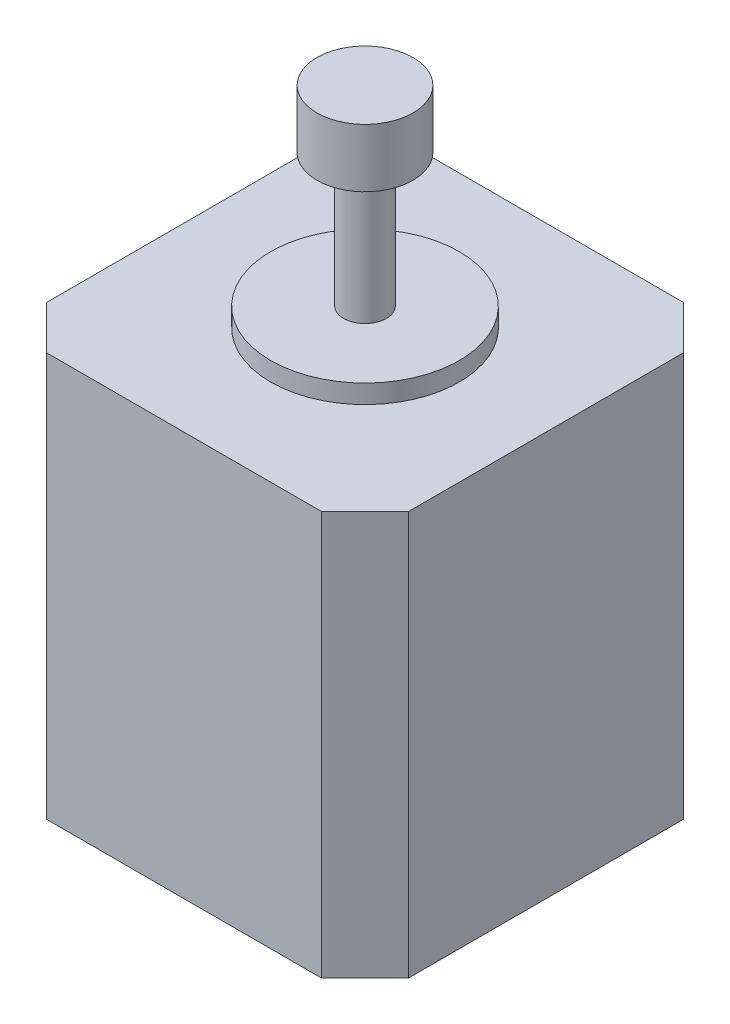
ISO-10303-21;
HEADER;
FILE_DESCRIPTION(('STEP AP214'),'2;1');
FILE_NAME('part.step','',(''),(''),'','','');
FILE_SCHEMA(('AUTOMOTIVE_DESIGN { 1 0 10303 214 1 1 1 1 }'));
ENDSEC;
DATA;
#1=APPLICATION_CONTEXT('core data for automotive mechanical design processes');
#2=APPLICATION_PROTOCOL_DEFINITION('international standard','automotive_design',2000,#1);
#3=PRODUCT_CONTEXT('',#1,'mechanical');
#4=PRODUCT('Part','Part','',(#3));
#5=PRODUCT_RELATED_PRODUCT_CATEGORY('part','',(#4));
#6=PRODUCT_DEFINITION_FORMATION('','',#4);
#7=PRODUCT_DEFINITION_CONTEXT('part definition',#1,'design');
#8=PRODUCT_DEFINITION('design','',#6,#7);
#9=PRODUCT_DEFINITION_SHAPE('','',#8);
#10=(LENGTH_UNIT() NAMED_UNIT(*) SI_UNIT(.MILLI.,.METRE.));
#11=(NAMED_UNIT(*) PLANE_ANGLE_UNIT() SI_UNIT($,.RADIAN.));
#12=(NAMED_UNIT(*) SI_UNIT($,.STERADIAN.) SOLID_ANGLE_UNIT());
#13=UNCERTAINTY_MEASURE_WITH_UNIT(LENGTH_MEASURE(1.E-05),#10,'distance_accuracy_value','');
#14=(GEOMETRIC_REPRESENTATION_CONTEXT(3) GLOBAL_UNCERTAINTY_ASSIGNED_CONTEXT((#13)) GLOBAL_UNIT_ASSIGNED_CONTEXT((#10,
#11,#12)) REPRESENTATION_CONTEXT('',''));
#15=CARTESIAN_POINT('',(0.,0.,0.));
#16=DIRECTION('',(0.,0.,1.));
#17=DIRECTION('',(1.,0.,0.));
#18=AXIS2_PLACEMENT_3D('',#15,#16,#17);
#19=CARTESIAN_POINT('',(21.0693,49.1998,-21.0693));
#20=DIRECTION('',(0.,1.,0.));
#21=DIRECTION('',(0.,0.,1.));
#22=AXIS2_PLACEMENT_3D('',#19,#20,#21);
#23=PLANE('',#22);
#24=CARTESIAN_POINT('',(21.0693,49.1998,-21.0693));
#25=DIRECTION('',(0.,1.,0.));
#26=DIRECTION('',(0.,0.,1.));
#27=AXIS2_PLACEMENT_3D('',#24,#25,#26);
#28=CIRCLE('',#27,10.97915);
#29=CARTESIAN_POINT('',(21.0693,49.1998,-10.09015));
#30=VERTEX_POINT('',#29);
#31=EDGE_CURVE('E162',#30,#30,#28,.T.);
#32=ORIENTED_EDGE('',*,*,#31,.T.);
#33=EDGE_LOOP('',(#32));
#34=FACE_BOUND('',#33,.T.);
#35=CARTESIAN_POINT('',(21.0693,49.1998,-21.0693));
#36=DIRECTION('',(0.,1.,0.));
#37=DIRECTION('',(0.,0.,1.));
#38=AXIS2_PLACEMENT_3D('',#35,#36,#37);
#39=CIRCLE('',#38,2.49555);
#40=CARTESIAN_POINT('',(21.0693,49.1998,-18.57375));
#41=VERTEX_POINT('',#40);
#42=EDGE_CURVE('E172',#41,#41,#39,.T.);
#43=ORIENTED_EDGE('',*,*,#42,.F.);
#44=EDGE_LOOP('',(#43));
#45=FACE_BOUND('',#44,.T.);
#46=ADVANCED_FACE('F33',(#34,#45),#23,.T.);
#47=CARTESIAN_POINT('',(0.,47.0281,0.));
#48=DIRECTION('',(0.,-1.,0.));
#49=DIRECTION('',(0.,0.,-1.));
#50=AXIS2_PLACEMENT_3D('',#47,#48,#49);
#51=PLANE('',#50);
#52=DIRECTION('',(-1.,0.,0.));
#53=VECTOR('',#52,1.);
#54=CARTESIAN_POINT('',(0.,47.0281,-42.1386));
#55=LINE('',#54,#53);
#56=CARTESIAN_POINT('',(37.0586,47.0281,-42.1386));
#57=VERTEX_POINT('',#56);
#58=CARTESIAN_POINT('',(5.08000000000003,47.0281,-42.1386));
#59=VERTEX_POINT('',#58);
#60=EDGE_CURVE('E110',#57,#59,#55,.T.);
#61=ORIENTED_EDGE('',*,*,#60,.T.);
#62=DIRECTION('',(0.707106781186549,0.,-0.707106781186546));
#63=VECTOR('',#62,1.);
#64=CARTESIAN_POINT('',(0.,47.0281,-37.0586));
#65=LINE('',#64,#63);
#66=CARTESIAN_POINT('',(0.,47.0281,-37.0586));
#67=VERTEX_POINT('',#66);
#68=EDGE_CURVE('E11',#59,#67,#65,.F.);
#69=ORIENTED_EDGE('',*,*,#68,.T.);
#70=DIRECTION('',(0.,0.,1.));
#71=VECTOR('',#70,1.);
#72=CARTESIAN_POINT('',(0.,47.0281,0.));
#73=LINE('',#72,#71);
#74=CARTESIAN_POINT('',(0.,47.0281,-5.08000000000002));
#75=VERTEX_POINT('',#74);
#76=EDGE_CURVE('E114',#67,#75,#73,.T.);
#77=ORIENTED_EDGE('',*,*,#76,.T.);
#78=DIRECTION('',(-0.707106781186546,0.,-0.707106781186549));
#79=VECTOR('',#78,1.);
#80=CARTESIAN_POINT('',(5.08,47.0281,0.));
#81=LINE('',#80,#79);
#82=CARTESIAN_POINT('',(5.08,47.0281,0.));
#83=VERTEX_POINT('',#82);
#84=EDGE_CURVE('E148',#75,#83,#81,.F.);
#85=ORIENTED_EDGE('',*,*,#84,.T.);
#86=DIRECTION('',(1.,0.,0.));
#87=VECTOR('',#86,1.);
#88=CARTESIAN_POINT('',(0.,47.0281,0.));
#89=LINE('',#88,#87);
#90=CARTESIAN_POINT('',(37.0586,47.0281,0.));
#91=VERTEX_POINT('',#90);
#92=EDGE_CURVE('E117',#83,#91,#89,.T.);
#93=ORIENTED_EDGE('',*,*,#92,.T.);
#94=DIRECTION('',(-0.707106781186549,0.,0.707106781186546));
#95=VECTOR('',#94,1.);
#96=CARTESIAN_POINT('',(42.1386,47.0281,-5.08));
#97=LINE('',#96,#95);
#98=CARTESIAN_POINT('',(42.1386,47.0281,-5.08));
#99=VERTEX_POINT('',#98);
#100=EDGE_CURVE('E137',#91,#99,#97,.F.);
#101=ORIENTED_EDGE('',*,*,#100,.T.);
#102=DIRECTION('',(0.,0.,-1.));
#103=VECTOR('',#102,1.);
#104=CARTESIAN_POINT('',(42.1386,47.0281,0.));
#105=LINE('',#104,#103);
#106=CARTESIAN_POINT('',(42.1386,47.0281,-37.0586));
#107=VERTEX_POINT('',#106);
#108=EDGE_CURVE('E169',#99,#107,#105,.T.);
#109=ORIENTED_EDGE('',*,*,#108,.T.);
#110=DIRECTION('',(0.707106781186546,0.,0.707106781186549));
#111=VECTOR('',#110,1.);
#112=CARTESIAN_POINT('',(37.0586,47.0281,-42.1386));
#113=LINE('',#112,#111);
#114=EDGE_CURVE('E126',#107,#57,#113,.F.);
#115=ORIENTED_EDGE('',*,*,#114,.T.);
#116=EDGE_LOOP('',(#61,#69,#77,#85,#93,#101,#109,#115));
#117=FACE_BOUND('',#116,.T.);
#118=CARTESIAN_POINT('',(21.0693,47.0281,-21.0693));
#119=DIRECTION('',(0.,-1.,0.));
#120=DIRECTION('',(0.,0.,-1.));
#121=AXIS2_PLACEMENT_3D('',#118,#119,#120);
#122=CIRCLE('',#121,10.97915);
#123=CARTESIAN_POINT('',(21.0693,47.0281,-32.04845));
#124=VERTEX_POINT('',#123);
#125=EDGE_CURVE('E111',#124,#124,#122,.F.);
#126=ORIENTED_EDGE('',*,*,#125,.F.);
#127=EDGE_LOOP('',(#126));
#128=FACE_BOUND('',#127,.T.);
#129=ADVANCED_FACE('F206',(#117,#128),#51,.F.);
#130=CARTESIAN_POINT('',(0.,47.0281,0.));
#131=DIRECTION('',(1.,0.,0.));
#132=DIRECTION('',(0.,0.,-1.));
#133=AXIS2_PLACEMENT_3D('',#130,#131,#132);
#134=PLANE('',#133);
#135=ORIENTED_EDGE('',*,*,#76,.F.);
#136=DIRECTION('',(0.,-1.,0.));
#137=VECTOR('',#136,1.);
#138=CARTESIAN_POINT('',(0.,47.0281,-37.0586));
#139=LINE('',#138,#137);
#140=CARTESIAN_POINT('',(0.,0.,-37.0586));
#141=VERTEX_POINT('',#140);
#142=EDGE_CURVE('E150',#67,#141,#139,.T.);
#143=ORIENTED_EDGE('',*,*,#142,.T.);
#144=DIRECTION('',(0.,0.,1.));
#145=VECTOR('',#144,1.);
#146=CARTESIAN_POINT('',(0.,0.,0.));
#147=LINE('',#146,#145);
#148=CARTESIAN_POINT('',(0.,0.,-5.08000000000002));
#149=VERTEX_POINT('',#148);
#150=EDGE_CURVE('E157',#141,#149,#147,.T.);
#151=ORIENTED_EDGE('',*,*,#150,.T.);
#152=DIRECTION('',(0.,1.,0.));
#153=VECTOR('',#152,1.);
#154=CARTESIAN_POINT('',(0.,47.0281,-5.08000000000002));
#155=LINE('',#154,#153);
#156=EDGE_CURVE('E145',#149,#75,#155,.T.);
#157=ORIENTED_EDGE('',*,*,#156,.T.);
#158=EDGE_LOOP('',(#135,#143,#151,#157));
#159=FACE_BOUND('',#158,.T.);
#160=ADVANCED_FACE('F156',(#159),#134,.F.);
#161=CARTESIAN_POINT('',(0.,47.0281,0.));
#162=DIRECTION('',(0.,0.,-1.));
#163=DIRECTION('',(-1.,0.,0.));
#164=AXIS2_PLACEMENT_3D('',#161,#162,#163);
#165=PLANE('',#164);
#166=ORIENTED_EDGE('',*,*,#92,.F.);
#167=DIRECTION('',(0.,-1.,0.));
#168=VECTOR('',#167,1.);
#169=CARTESIAN_POINT('',(5.08,47.0281,0.));
#170=LINE('',#169,#168);
#171=CARTESIAN_POINT('',(5.08,0.,0.));
#172=VERTEX_POINT('',#171);
#173=EDGE_CURVE('E139',#83,#172,#170,.T.);
#174=ORIENTED_EDGE('',*,*,#173,.T.);
#175=DIRECTION('',(1.,0.,0.));
#176=VECTOR('',#175,1.);
#177=CARTESIAN_POINT('',(0.,0.,0.));
#178=LINE('',#177,#176);
#179=CARTESIAN_POINT('',(37.0586,0.,0.));
#180=VERTEX_POINT('',#179);
#181=EDGE_CURVE('E119',#172,#180,#178,.T.);
#182=ORIENTED_EDGE('',*,*,#181,.T.);
#183=DIRECTION('',(0.,1.,0.));
#184=VECTOR('',#183,1.);
#185=CARTESIAN_POINT('',(37.0586,47.0281,0.));
#186=LINE('',#185,#184);
#187=EDGE_CURVE('E134',#180,#91,#186,.T.);
#188=ORIENTED_EDGE('',*,*,#187,.T.);
#189=EDGE_LOOP('',(#166,#174,#182,#188));
#190=FACE_BOUND('',#189,.T.);
#191=ADVANCED_FACE('F225',(#190),#165,.F.);
#192=CARTESIAN_POINT('',(42.1386,47.0281,0.));
#193=DIRECTION('',(-1.,0.,0.));
#194=DIRECTION('',(0.,0.,1.));
#195=AXIS2_PLACEMENT_3D('',#192,#193,#194);
#196=PLANE('',#195);
#197=ORIENTED_EDGE('',*,*,#108,.F.);
#198=DIRECTION('',(0.,-1.,0.));
#199=VECTOR('',#198,1.);
#200=CARTESIAN_POINT('',(42.1386,47.0281,-5.08));
#201=LINE('',#200,#199);
#202=CARTESIAN_POINT('',(42.1386,0.,-5.08));
#203=VERTEX_POINT('',#202);
#204=EDGE_CURVE('E128',#99,#203,#201,.T.);
#205=ORIENTED_EDGE('',*,*,#204,.T.);
#206=DIRECTION('',(0.,0.,-1.));
#207=VECTOR('',#206,1.);
#208=CARTESIAN_POINT('',(42.1386,0.,0.));
#209=LINE('',#208,#207);
#210=CARTESIAN_POINT('',(42.1386,0.,-37.0586));
#211=VERTEX_POINT('',#210);
#212=EDGE_CURVE('E115',#203,#211,#209,.T.);
#213=ORIENTED_EDGE('',*,*,#212,.T.);
#214=DIRECTION('',(0.,1.,0.));
#215=VECTOR('',#214,1.);
#216=CARTESIAN_POINT('',(42.1386,47.0281,-37.0586));
#217=LINE('',#216,#215);
#218=EDGE_CURVE('E105',#211,#107,#217,.T.);
#219=ORIENTED_EDGE('',*,*,#218,.T.);
#220=EDGE_LOOP('',(#197,#205,#213,#219));
#221=FACE_BOUND('',#220,.T.);
#222=ADVANCED_FACE('F222',(#221),#196,.F.);
#223=CARTESIAN_POINT('',(0.,47.0281,-42.1386));
#224=DIRECTION('',(0.,0.,1.));
#225=DIRECTION('',(1.,0.,0.));
#226=AXIS2_PLACEMENT_3D('',#223,#224,#225);
#227=PLANE('',#226);
#228=DIRECTION('',(-1.,0.,0.));
#229=VECTOR('',#228,1.);
#230=CARTESIAN_POINT('',(0.,0.,-42.1386));
#231=LINE('',#230,#229);
#232=CARTESIAN_POINT('',(37.0586,0.,-42.1386));
#233=VERTEX_POINT('',#232);
#234=CARTESIAN_POINT('',(5.08000000000003,0.,-42.1386));
#235=VERTEX_POINT('',#234);
#236=EDGE_CURVE('E109',#233,#235,#231,.T.);
#237=ORIENTED_EDGE('',*,*,#236,.T.);
#238=DIRECTION('',(0.,1.,0.));
#239=VECTOR('',#238,1.);
#240=CARTESIAN_POINT('',(5.08000000000003,47.0281,-42.1386));
#241=LINE('',#240,#239);
#242=EDGE_CURVE('E41',#235,#59,#241,.T.);
#243=ORIENTED_EDGE('',*,*,#242,.T.);
#244=ORIENTED_EDGE('',*,*,#60,.F.);
#245=DIRECTION('',(0.,-1.,0.));
#246=VECTOR('',#245,1.);
#247=CARTESIAN_POINT('',(37.0586,47.0281,-42.1386));
#248=LINE('',#247,#246);
#249=EDGE_CURVE('E103',#57,#233,#248,.T.);
#250=ORIENTED_EDGE('',*,*,#249,.T.);
#251=EDGE_LOOP('',(#237,#243,#244,#250));
#252=FACE_BOUND('',#251,.T.);
#253=ADVANCED_FACE('F108',(#252),#227,.F.);
#254=CARTESIAN_POINT('',(0.,0.,0.));
#255=DIRECTION('',(0.,-1.,0.));
#256=DIRECTION('',(0.,0.,-1.));
#257=AXIS2_PLACEMENT_3D('',#254,#255,#256);
#258=PLANE('',#257);
#259=ORIENTED_EDGE('',*,*,#150,.F.);
#260=DIRECTION('',(-0.707106781186549,0.,0.707106781186546));
#261=VECTOR('',#260,1.);
#262=CARTESIAN_POINT('',(-18.5293,0.,-18.5293000000001));
#263=LINE('',#262,#261);
#264=EDGE_CURVE('E55',#141,#235,#263,.F.);
#265=ORIENTED_EDGE('',*,*,#264,.T.);
#266=ORIENTED_EDGE('',*,*,#236,.F.);
#267=DIRECTION('',(-0.707106781186546,0.,-0.707106781186549));
#268=VECTOR('',#267,1.);
#269=CARTESIAN_POINT('',(39.5986000000001,0.,-39.5985999999999));
#270=LINE('',#269,#268);
#271=EDGE_CURVE('E99',#233,#211,#270,.F.);
#272=ORIENTED_EDGE('',*,*,#271,.T.);
#273=ORIENTED_EDGE('',*,*,#212,.F.);
#274=DIRECTION('',(0.707106781186549,0.,-0.707106781186546));
#275=VECTOR('',#274,1.);
#276=CARTESIAN_POINT('',(18.5292999999999,0.,18.5293));
#277=LINE('',#276,#275);
#278=EDGE_CURVE('E131',#203,#180,#277,.F.);
#279=ORIENTED_EDGE('',*,*,#278,.T.);
#280=ORIENTED_EDGE('',*,*,#181,.F.);
#281=DIRECTION('',(0.707106781186546,0.,0.707106781186549));
#282=VECTOR('',#281,1.);
#283=CARTESIAN_POINT('',(2.54000000000001,0.,-2.54));
#284=LINE('',#283,#282);
#285=EDGE_CURVE('E142',#172,#149,#284,.F.);
#286=ORIENTED_EDGE('',*,*,#285,.T.);
#287=EDGE_LOOP('',(#259,#265,#266,#272,#273,#279,#280,#286));
#288=FACE_BOUND('',#287,.T.);
#289=ADVANCED_FACE('F113',(#288),#258,.T.);
#290=CARTESIAN_POINT('',(21.0693,49.1998,-21.0693));
#291=DIRECTION('',(0.,-1.,0.));
#292=DIRECTION('',(0.,0.,-1.));
#293=AXIS2_PLACEMENT_3D('',#290,#291,#292);
#294=CYLINDRICAL_SURFACE('',#293,10.97915);
#295=ORIENTED_EDGE('',*,*,#31,.F.);
#296=EDGE_LOOP('',(#295));
#297=FACE_BOUND('',#296,.T.);
#298=ORIENTED_EDGE('',*,*,#125,.T.);
#299=EDGE_LOOP('',(#298));
#300=FACE_BOUND('',#299,.T.);
#301=ADVANCED_FACE('F201',(#297,#300),#294,.T.);
#302=CARTESIAN_POINT('',(21.0693,64.6684,-21.0693));
#303=DIRECTION('',(0.,-1.,0.));
#304=DIRECTION('',(0.,0.,-1.));
#305=AXIS2_PLACEMENT_3D('',#302,#303,#304);
#306=CYLINDRICAL_SURFACE('',#305,2.49555);
#307=CARTESIAN_POINT('',(21.0693,64.6684,-21.0693));
#308=DIRECTION('',(0.,1.,0.));
#309=DIRECTION('',(0.,0.,1.));
#310=AXIS2_PLACEMENT_3D('',#307,#308,#309);
#311=CIRCLE('',#310,2.49555);
#312=CARTESIAN_POINT('',(21.0693,64.6684,-18.57375));
#313=VERTEX_POINT('',#312);
#314=EDGE_CURVE('E165',#313,#313,#311,.T.);
#315=ORIENTED_EDGE('',*,*,#314,.F.);
#316=EDGE_LOOP('',(#315));
#317=FACE_BOUND('',#316,.T.);
#318=ORIENTED_EDGE('',*,*,#42,.T.);
#319=EDGE_LOOP('',(#318));
#320=FACE_BOUND('',#319,.T.);
#321=ADVANCED_FACE('F198',(#317,#320),#306,.T.);
#322=CARTESIAN_POINT('',(37.0586,47.0281,-42.1386));
#323=DIRECTION('',(-0.707106781186549,0.,0.707106781186546));
#324=DIRECTION('',(0.,-1.,0.));
#325=AXIS2_PLACEMENT_3D('',#322,#323,#324);
#326=PLANE('',#325);
#327=ORIENTED_EDGE('',*,*,#114,.F.);
#328=ORIENTED_EDGE('',*,*,#218,.F.);
#329=ORIENTED_EDGE('',*,*,#271,.F.);
#330=ORIENTED_EDGE('',*,*,#249,.F.);
#331=EDGE_LOOP('',(#327,#328,#329,#330));
#332=FACE_BOUND('',#331,.T.);
#333=ADVANCED_FACE('F102',(#332),#326,.F.);
#334=CARTESIAN_POINT('',(42.1386,47.0281,-5.08));
#335=DIRECTION('',(-0.707106781186546,0.,-0.707106781186549));
#336=DIRECTION('',(0.,-1.,0.));
#337=AXIS2_PLACEMENT_3D('',#334,#335,#336);
#338=PLANE('',#337);
#339=ORIENTED_EDGE('',*,*,#100,.F.);
#340=ORIENTED_EDGE('',*,*,#187,.F.);
#341=ORIENTED_EDGE('',*,*,#278,.F.);
#342=ORIENTED_EDGE('',*,*,#204,.F.);
#343=EDGE_LOOP('',(#339,#340,#341,#342));
#344=FACE_BOUND('',#343,.T.);
#345=ADVANCED_FACE('F234',(#344),#338,.F.);
#346=CARTESIAN_POINT('',(5.08,47.0281,0.));
#347=DIRECTION('',(0.707106781186549,0.,-0.707106781186546));
#348=DIRECTION('',(0.,-1.,0.));
#349=AXIS2_PLACEMENT_3D('',#346,#347,#348);
#350=PLANE('',#349);
#351=ORIENTED_EDGE('',*,*,#84,.F.);
#352=ORIENTED_EDGE('',*,*,#156,.F.);
#353=ORIENTED_EDGE('',*,*,#285,.F.);
#354=ORIENTED_EDGE('',*,*,#173,.F.);
#355=EDGE_LOOP('',(#351,#352,#353,#354));
#356=FACE_BOUND('',#355,.T.);
#357=ADVANCED_FACE('F236',(#356),#350,.F.);
#358=CARTESIAN_POINT('',(0.,47.0281,-37.0586));
#359=DIRECTION('',(0.707106781186546,0.,0.707106781186549));
#360=DIRECTION('',(0.,-1.,0.));
#361=AXIS2_PLACEMENT_3D('',#358,#359,#360);
#362=PLANE('',#361);
#363=ORIENTED_EDGE('',*,*,#68,.F.);
#364=ORIENTED_EDGE('',*,*,#242,.F.);
#365=ORIENTED_EDGE('',*,*,#264,.F.);
#366=ORIENTED_EDGE('',*,*,#142,.F.);
#367=EDGE_LOOP('',(#363,#364,#365,#366));
#368=FACE_BOUND('',#367,.T.);
#369=ADVANCED_FACE('F35',(#368),#362,.F.);
#370=CARTESIAN_POINT('',(21.0693,64.6684,-21.0693));
#371=DIRECTION('',(0.,1.,0.));
#372=DIRECTION('',(0.,0.,1.));
#373=AXIS2_PLACEMENT_3D('',#370,#371,#372);
#374=PLANE('',#373);
#375=CARTESIAN_POINT('',(21.0693,64.6684,-21.0693));
#376=DIRECTION('',(0.,1.,0.));
#377=DIRECTION('',(0.,0.,1.));
#378=AXIS2_PLACEMENT_3D('',#375,#376,#377);
#379=CIRCLE('',#378,5.588);
#380=CARTESIAN_POINT('',(21.0693,64.6684,-15.4813));
#381=VERTEX_POINT('',#380);
#382=EDGE_CURVE('E178',#381,#381,#379,.T.);
#383=ORIENTED_EDGE('',*,*,#382,.F.);
#384=EDGE_LOOP('',(#383));
#385=FACE_BOUND('',#384,.T.);
#386=ORIENTED_EDGE('',*,*,#314,.T.);
#387=EDGE_LOOP('',(#386));
#388=FACE_BOUND('',#387,.T.);
#389=ADVANCED_FACE('F189',(#385,#388),#374,.F.);
#390=CARTESIAN_POINT('',(21.0693,71.4629,-21.0693));
#391=DIRECTION('',(0.,-1.,0.));
#392=DIRECTION('',(0.,0.,-1.));
#393=AXIS2_PLACEMENT_3D('',#390,#391,#392);
#394=CYLINDRICAL_SURFACE('',#393,5.588);
#395=CARTESIAN_POINT('',(21.0693,71.4629,-21.0693));
#396=DIRECTION('',(0.,1.,0.));
#397=DIRECTION('',(0.,0.,1.));
#398=AXIS2_PLACEMENT_3D('',#395,#396,#397);
#399=CIRCLE('',#398,5.588);
#400=CARTESIAN_POINT('',(21.0693,71.4629,-15.4813));
#401=VERTEX_POINT('',#400);
#402=EDGE_CURVE('E175',#401,#401,#399,.T.);
#403=ORIENTED_EDGE('',*,*,#402,.F.);
#404=EDGE_LOOP('',(#403));
#405=FACE_BOUND('',#404,.T.);
#406=ORIENTED_EDGE('',*,*,#382,.T.);
#407=EDGE_LOOP('',(#406));
#408=FACE_BOUND('',#407,.T.);
#409=ADVANCED_FACE('F186',(#405,#408),#394,.T.);
#410=CARTESIAN_POINT('',(21.0693,71.4629,-21.0693));
#411=DIRECTION('',(0.,1.,0.));
#412=DIRECTION('',(0.,0.,1.));
#413=AXIS2_PLACEMENT_3D('',#410,#411,#412);
#414=PLANE('',#413);
#415=ORIENTED_EDGE('',*,*,#402,.T.);
#416=EDGE_LOOP('',(#415));
#417=FACE_BOUND('',#416,.T.);
#418=ADVANCED_FACE('F184',(#417),#414,.T.);
#419=CLOSED_SHELL('',(#46,#129,#160,#191,#222,#253,#289,#301,#321,#333,#345,#357,#369,#389,#409,#418));
#420=MANIFOLD_SOLID_BREP('B2',#419);
#421=ADVANCED_BREP_SHAPE_REPRESENTATION('',(#18,#420),#14);
#422=SHAPE_DEFINITION_REPRESENTATION(#9,#421);
ENDSEC;
END-ISO-10303-21;
